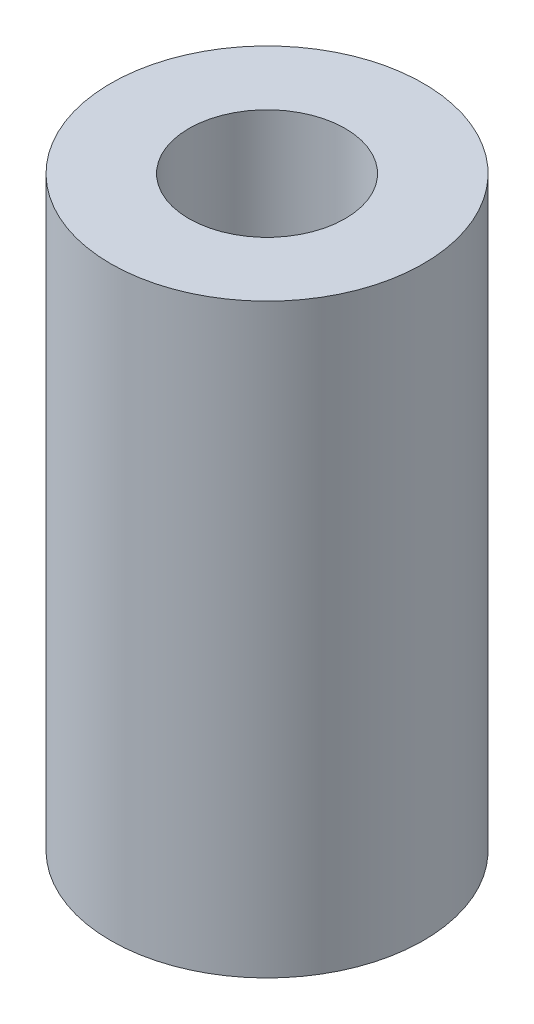
ISO-10303-21;
HEADER;
FILE_DESCRIPTION(('STEP AP214'),'2;1');
FILE_NAME('part.step','',(''),(''),'','','');
FILE_SCHEMA(('AUTOMOTIVE_DESIGN { 1 0 10303 214 1 1 1 1 }'));
ENDSEC;
DATA;
#1=APPLICATION_CONTEXT('core data for automotive mechanical design processes');
#2=APPLICATION_PROTOCOL_DEFINITION('international standard','automotive_design',2000,#1);
#3=PRODUCT_CONTEXT('',#1,'mechanical');
#4=PRODUCT('Part','Part','',(#3));
#5=PRODUCT_RELATED_PRODUCT_CATEGORY('part','',(#4));
#6=PRODUCT_DEFINITION_FORMATION('','',#4);
#7=PRODUCT_DEFINITION_CONTEXT('part definition',#1,'design');
#8=PRODUCT_DEFINITION('design','',#6,#7);
#9=PRODUCT_DEFINITION_SHAPE('','',#8);
#10=(LENGTH_UNIT() NAMED_UNIT(*) SI_UNIT(.MILLI.,.METRE.));
#11=(NAMED_UNIT(*) PLANE_ANGLE_UNIT() SI_UNIT($,.RADIAN.));
#12=(NAMED_UNIT(*) SI_UNIT($,.STERADIAN.) SOLID_ANGLE_UNIT());
#13=UNCERTAINTY_MEASURE_WITH_UNIT(LENGTH_MEASURE(1.E-05),#10,'distance_accuracy_value','');
#14=(GEOMETRIC_REPRESENTATION_CONTEXT(3) GLOBAL_UNCERTAINTY_ASSIGNED_CONTEXT((#13)) GLOBAL_UNIT_ASSIGNED_CONTEXT((#10,
#11,#12)) REPRESENTATION_CONTEXT('',''));
#15=CARTESIAN_POINT('',(0.,0.,0.));
#16=DIRECTION('',(0.,0.,1.));
#17=DIRECTION('',(1.,0.,0.));
#18=AXIS2_PLACEMENT_3D('',#15,#16,#17);
#19=CARTESIAN_POINT('',(0.,30.,0.));
#20=DIRECTION('',(0.,1.,0.));
#21=DIRECTION('',(0.,0.,1.));
#22=AXIS2_PLACEMENT_3D('',#19,#20,#21);
#23=PLANE('',#22);
#24=CARTESIAN_POINT('',(0.,30.,0.));
#25=DIRECTION('',(0.,1.,0.));
#26=DIRECTION('',(0.,0.,1.));
#27=AXIS2_PLACEMENT_3D('',#24,#25,#26);
#28=CIRCLE('',#27,8.);
#29=CARTESIAN_POINT('',(0.,30.,8.));
#30=VERTEX_POINT('',#29);
#31=EDGE_CURVE('E10',#30,#30,#28,.T.);
#32=ORIENTED_EDGE('',*,*,#31,.T.);
#33=EDGE_LOOP('',(#32));
#34=FACE_BOUND('',#33,.T.);
#35=CARTESIAN_POINT('',(0.,30.,0.));
#36=DIRECTION('',(0.,1.,0.));
#37=DIRECTION('',(0.,0.,1.));
#38=AXIS2_PLACEMENT_3D('',#35,#36,#37);
#39=CIRCLE('',#38,4.);
#40=CARTESIAN_POINT('',(0.,30.,4.));
#41=VERTEX_POINT('',#40);
#42=EDGE_CURVE('E52',#41,#41,#39,.T.);
#43=ORIENTED_EDGE('',*,*,#42,.F.);
#44=EDGE_LOOP('',(#43));
#45=FACE_BOUND('',#44,.T.);
#46=ADVANCED_FACE('F39',(#34,#45),#23,.T.);
#47=CARTESIAN_POINT('',(0.,0.,0.));
#48=DIRECTION('',(0.,1.,0.));
#49=DIRECTION('',(0.,0.,1.));
#50=AXIS2_PLACEMENT_3D('',#47,#48,#49);
#51=PLANE('',#50);
#52=CARTESIAN_POINT('',(0.,0.,0.));
#53=DIRECTION('',(0.,1.,0.));
#54=DIRECTION('',(0.,0.,1.));
#55=AXIS2_PLACEMENT_3D('',#52,#53,#54);
#56=CIRCLE('',#55,8.);
#57=CARTESIAN_POINT('',(0.,0.,8.));
#58=VERTEX_POINT('',#57);
#59=EDGE_CURVE('E43',#58,#58,#56,.T.);
#60=ORIENTED_EDGE('',*,*,#59,.F.);
#61=EDGE_LOOP('',(#60));
#62=FACE_BOUND('',#61,.T.);
#63=CARTESIAN_POINT('',(0.,0.,0.));
#64=DIRECTION('',(0.,1.,0.));
#65=DIRECTION('',(0.,0.,1.));
#66=AXIS2_PLACEMENT_3D('',#63,#64,#65);
#67=CIRCLE('',#66,4.);
#68=CARTESIAN_POINT('',(0.,0.,4.));
#69=VERTEX_POINT('',#68);
#70=EDGE_CURVE('E54',#69,#69,#67,.T.);
#71=ORIENTED_EDGE('',*,*,#70,.T.);
#72=EDGE_LOOP('',(#71));
#73=FACE_BOUND('',#72,.T.);
#74=ADVANCED_FACE('F66',(#62,#73),#51,.F.);
#75=CARTESIAN_POINT('',(0.,30.,0.));
#76=DIRECTION('',(0.,-1.,0.));
#77=DIRECTION('',(0.,0.,-1.));
#78=AXIS2_PLACEMENT_3D('',#75,#76,#77);
#79=CYLINDRICAL_SURFACE('',#78,8.);
#80=ORIENTED_EDGE('',*,*,#31,.F.);
#81=EDGE_LOOP('',(#80));
#82=FACE_BOUND('',#81,.T.);
#83=ORIENTED_EDGE('',*,*,#59,.T.);
#84=EDGE_LOOP('',(#83));
#85=FACE_BOUND('',#84,.T.);
#86=ADVANCED_FACE('F41',(#82,#85),#79,.T.);
#87=CARTESIAN_POINT('',(0.,30.,0.));
#88=DIRECTION('',(0.,-1.,0.));
#89=DIRECTION('',(0.,0.,-1.));
#90=AXIS2_PLACEMENT_3D('',#87,#88,#89);
#91=CYLINDRICAL_SURFACE('',#90,4.);
#92=ORIENTED_EDGE('',*,*,#42,.T.);
#93=EDGE_LOOP('',(#92));
#94=FACE_BOUND('',#93,.T.);
#95=ORIENTED_EDGE('',*,*,#70,.F.);
#96=EDGE_LOOP('',(#95));
#97=FACE_BOUND('',#96,.T.);
#98=ADVANCED_FACE('F62',(#94,#97),#91,.F.);
#99=CLOSED_SHELL('',(#46,#74,#86,#98));
#100=MANIFOLD_SOLID_BREP('B2',#99);
#101=ADVANCED_BREP_SHAPE_REPRESENTATION('',(#18,#100),#14);
#102=SHAPE_DEFINITION_REPRESENTATION(#9,#101);
ENDSEC;
END-ISO-10303-21;
